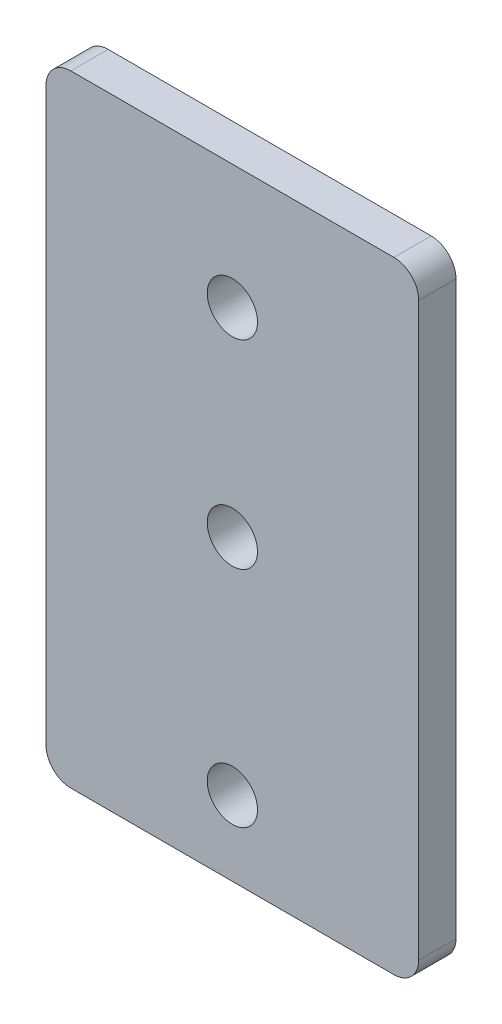
ISO-10303-21;
HEADER;
FILE_DESCRIPTION(('STEP AP214'),'2;1');
FILE_NAME('part.step','',(''),(''),'','','');
FILE_SCHEMA(('AUTOMOTIVE_DESIGN { 1 0 10303 214 1 1 1 1 }'));
ENDSEC;
DATA;
#1=APPLICATION_CONTEXT('core data for automotive mechanical design processes');
#2=APPLICATION_PROTOCOL_DEFINITION('international standard','automotive_design',2000,#1);
#3=PRODUCT_CONTEXT('',#1,'mechanical');
#4=PRODUCT('Part','Part','',(#3));
#5=PRODUCT_RELATED_PRODUCT_CATEGORY('part','',(#4));
#6=PRODUCT_DEFINITION_FORMATION('','',#4);
#7=PRODUCT_DEFINITION_CONTEXT('part definition',#1,'design');
#8=PRODUCT_DEFINITION('design','',#6,#7);
#9=PRODUCT_DEFINITION_SHAPE('','',#8);
#10=(LENGTH_UNIT() NAMED_UNIT(*) SI_UNIT(.MILLI.,.METRE.));
#11=(NAMED_UNIT(*) PLANE_ANGLE_UNIT() SI_UNIT($,.RADIAN.));
#12=(NAMED_UNIT(*) SI_UNIT($,.STERADIAN.) SOLID_ANGLE_UNIT());
#13=UNCERTAINTY_MEASURE_WITH_UNIT(LENGTH_MEASURE(1.E-05),#10,'distance_accuracy_value','');
#14=(GEOMETRIC_REPRESENTATION_CONTEXT(3) GLOBAL_UNCERTAINTY_ASSIGNED_CONTEXT((#13)) GLOBAL_UNIT_ASSIGNED_CONTEXT((#10,
#11,#12)) REPRESENTATION_CONTEXT('',''));
#15=CARTESIAN_POINT('',(0.,0.,0.));
#16=DIRECTION('',(0.,0.,1.));
#17=DIRECTION('',(1.,0.,0.));
#18=AXIS2_PLACEMENT_3D('',#15,#16,#17);
#19=CARTESIAN_POINT('',(15.,-25.,3.));
#20=DIRECTION('',(-1.,0.,0.));
#21=DIRECTION('',(0.,0.,1.));
#22=AXIS2_PLACEMENT_3D('',#19,#20,#21);
#23=PLANE('',#22);
#24=DIRECTION('',(0.,1.,0.));
#25=VECTOR('',#24,1.);
#26=CARTESIAN_POINT('',(15.,-25.,0.));
#27=LINE('',#26,#25);
#28=CARTESIAN_POINT('',(15.,-23.,0.));
#29=VERTEX_POINT('',#28);
#30=CARTESIAN_POINT('',(15.,23.,0.));
#31=VERTEX_POINT('',#30);
#32=EDGE_CURVE('E130',#29,#31,#27,.T.);
#33=ORIENTED_EDGE('',*,*,#32,.T.);
#34=DIRECTION('',(0.,0.,-1.));
#35=VECTOR('',#34,1.);
#36=CARTESIAN_POINT('',(15.,23.,3.));
#37=LINE('',#36,#35);
#38=CARTESIAN_POINT('',(15.,23.,3.));
#39=VERTEX_POINT('',#38);
#40=EDGE_CURVE('E164',#31,#39,#37,.F.);
#41=ORIENTED_EDGE('',*,*,#40,.T.);
#42=DIRECTION('',(0.,1.,0.));
#43=VECTOR('',#42,1.);
#44=CARTESIAN_POINT('',(15.,-25.,3.));
#45=LINE('',#44,#43);
#46=CARTESIAN_POINT('',(15.,-23.,3.));
#47=VERTEX_POINT('',#46);
#48=EDGE_CURVE('E128',#47,#39,#45,.T.);
#49=ORIENTED_EDGE('',*,*,#48,.F.);
#50=DIRECTION('',(0.,0.,-1.));
#51=VECTOR('',#50,1.);
#52=CARTESIAN_POINT('',(15.,-23.,3.));
#53=LINE('',#52,#51);
#54=EDGE_CURVE('E161',#47,#29,#53,.T.);
#55=ORIENTED_EDGE('',*,*,#54,.T.);
#56=EDGE_LOOP('',(#33,#41,#49,#55));
#57=FACE_BOUND('',#56,.T.);
#58=ADVANCED_FACE('F35',(#57),#23,.F.);
#59=CARTESIAN_POINT('',(-15.,25.,3.));
#60=DIRECTION('',(0.,-1.,0.));
#61=DIRECTION('',(0.,0.,-1.));
#62=AXIS2_PLACEMENT_3D('',#59,#60,#61);
#63=PLANE('',#62);
#64=DIRECTION('',(-1.,0.,0.));
#65=VECTOR('',#64,1.);
#66=CARTESIAN_POINT('',(-15.,25.,0.));
#67=LINE('',#66,#65);
#68=CARTESIAN_POINT('',(13.,25.,0.));
#69=VERTEX_POINT('',#68);
#70=CARTESIAN_POINT('',(-13.,25.,0.));
#71=VERTEX_POINT('',#70);
#72=EDGE_CURVE('E126',#69,#71,#67,.T.);
#73=ORIENTED_EDGE('',*,*,#72,.T.);
#74=DIRECTION('',(0.,0.,-1.));
#75=VECTOR('',#74,1.);
#76=CARTESIAN_POINT('',(-13.,25.,3.));
#77=LINE('',#76,#75);
#78=CARTESIAN_POINT('',(-13.,25.,3.));
#79=VERTEX_POINT('',#78);
#80=EDGE_CURVE('E105',#71,#79,#77,.F.);
#81=ORIENTED_EDGE('',*,*,#80,.T.);
#82=DIRECTION('',(-1.,0.,0.));
#83=VECTOR('',#82,1.);
#84=CARTESIAN_POINT('',(-15.,25.,3.));
#85=LINE('',#84,#83);
#86=CARTESIAN_POINT('',(13.,25.,3.));
#87=VERTEX_POINT('',#86);
#88=EDGE_CURVE('E180',#87,#79,#85,.T.);
#89=ORIENTED_EDGE('',*,*,#88,.F.);
#90=DIRECTION('',(0.,0.,-1.));
#91=VECTOR('',#90,1.);
#92=CARTESIAN_POINT('',(13.,25.,3.));
#93=LINE('',#92,#91);
#94=EDGE_CURVE('E110',#87,#69,#93,.T.);
#95=ORIENTED_EDGE('',*,*,#94,.T.);
#96=EDGE_LOOP('',(#73,#81,#89,#95));
#97=FACE_BOUND('',#96,.T.);
#98=ADVANCED_FACE('F205',(#97),#63,.F.);
#99=CARTESIAN_POINT('',(-15.,-25.,3.));
#100=DIRECTION('',(1.,0.,0.));
#101=DIRECTION('',(0.,0.,-1.));
#102=AXIS2_PLACEMENT_3D('',#99,#100,#101);
#103=PLANE('',#102);
#104=DIRECTION('',(0.,-1.,0.));
#105=VECTOR('',#104,1.);
#106=CARTESIAN_POINT('',(-15.,-25.,3.));
#107=LINE('',#106,#105);
#108=CARTESIAN_POINT('',(-15.,23.,3.));
#109=VERTEX_POINT('',#108);
#110=CARTESIAN_POINT('',(-15.,-23.,3.));
#111=VERTEX_POINT('',#110);
#112=EDGE_CURVE('E119',#109,#111,#107,.T.);
#113=ORIENTED_EDGE('',*,*,#112,.F.);
#114=DIRECTION('',(0.,0.,-1.));
#115=VECTOR('',#114,1.);
#116=CARTESIAN_POINT('',(-15.,23.,3.));
#117=LINE('',#116,#115);
#118=CARTESIAN_POINT('',(-15.,23.,0.));
#119=VERTEX_POINT('',#118);
#120=EDGE_CURVE('E104',#109,#119,#117,.T.);
#121=ORIENTED_EDGE('',*,*,#120,.T.);
#122=DIRECTION('',(0.,-1.,0.));
#123=VECTOR('',#122,1.);
#124=CARTESIAN_POINT('',(-15.,-25.,0.));
#125=LINE('',#124,#123);
#126=CARTESIAN_POINT('',(-15.,-23.,0.));
#127=VERTEX_POINT('',#126);
#128=EDGE_CURVE('E117',#119,#127,#125,.T.);
#129=ORIENTED_EDGE('',*,*,#128,.T.);
#130=DIRECTION('',(0.,0.,-1.));
#131=VECTOR('',#130,1.);
#132=CARTESIAN_POINT('',(-15.,-23.,3.));
#133=LINE('',#132,#131);
#134=EDGE_CURVE('E121',#127,#111,#133,.F.);
#135=ORIENTED_EDGE('',*,*,#134,.T.);
#136=EDGE_LOOP('',(#113,#121,#129,#135));
#137=FACE_BOUND('',#136,.T.);
#138=ADVANCED_FACE('F116',(#137),#103,.F.);
#139=CARTESIAN_POINT('',(-15.,-25.,3.));
#140=DIRECTION('',(0.,1.,0.));
#141=DIRECTION('',(0.,0.,1.));
#142=AXIS2_PLACEMENT_3D('',#139,#140,#141);
#143=PLANE('',#142);
#144=DIRECTION('',(1.,0.,0.));
#145=VECTOR('',#144,1.);
#146=CARTESIAN_POINT('',(-15.,-25.,0.));
#147=LINE('',#146,#145);
#148=CARTESIAN_POINT('',(-13.,-25.,0.));
#149=VERTEX_POINT('',#148);
#150=CARTESIAN_POINT('',(13.,-25.,0.));
#151=VERTEX_POINT('',#150);
#152=EDGE_CURVE('E125',#149,#151,#147,.T.);
#153=ORIENTED_EDGE('',*,*,#152,.T.);
#154=DIRECTION('',(0.,0.,-1.));
#155=VECTOR('',#154,1.);
#156=CARTESIAN_POINT('',(13.,-25.,3.));
#157=LINE('',#156,#155);
#158=CARTESIAN_POINT('',(13.,-25.,3.));
#159=VERTEX_POINT('',#158);
#160=EDGE_CURVE('E11',#151,#159,#157,.F.);
#161=ORIENTED_EDGE('',*,*,#160,.T.);
#162=DIRECTION('',(1.,0.,0.));
#163=VECTOR('',#162,1.);
#164=CARTESIAN_POINT('',(-15.,-25.,3.));
#165=LINE('',#164,#163);
#166=CARTESIAN_POINT('',(-13.,-25.,3.));
#167=VERTEX_POINT('',#166);
#168=EDGE_CURVE('E145',#167,#159,#165,.T.);
#169=ORIENTED_EDGE('',*,*,#168,.F.);
#170=DIRECTION('',(0.,0.,-1.));
#171=VECTOR('',#170,1.);
#172=CARTESIAN_POINT('',(-13.,-25.,3.));
#173=LINE('',#172,#171);
#174=EDGE_CURVE('E43',#167,#149,#173,.T.);
#175=ORIENTED_EDGE('',*,*,#174,.T.);
#176=EDGE_LOOP('',(#153,#161,#169,#175));
#177=FACE_BOUND('',#176,.T.);
#178=ADVANCED_FACE('F167',(#177),#143,.F.);
#179=CARTESIAN_POINT('',(0.,0.,3.));
#180=DIRECTION('',(0.,0.,-1.));
#181=DIRECTION('',(-1.,0.,0.));
#182=AXIS2_PLACEMENT_3D('',#179,#180,#181);
#183=PLANE('',#182);
#184=CARTESIAN_POINT('',(0.,-0.999999999999999,3.));
#185=DIRECTION('',(0.,0.,1.));
#186=DIRECTION('',(1.,0.,0.));
#187=AXIS2_PLACEMENT_3D('',#184,#185,#186);
#188=CIRCLE('',#187,2.025);
#189=CARTESIAN_POINT('',(2.025,-0.999999999999999,3.));
#190=VERTEX_POINT('',#189);
#191=EDGE_CURVE('E142',#190,#190,#188,.T.);
#192=ORIENTED_EDGE('',*,*,#191,.F.);
#193=EDGE_LOOP('',(#192));
#194=FACE_BOUND('',#193,.T.);
#195=CARTESIAN_POINT('',(0.,-19.,3.));
#196=DIRECTION('',(0.,0.,1.));
#197=DIRECTION('',(1.,0.,0.));
#198=AXIS2_PLACEMENT_3D('',#195,#196,#197);
#199=CIRCLE('',#198,2.025);
#200=CARTESIAN_POINT('',(2.025,-19.,3.));
#201=VERTEX_POINT('',#200);
#202=EDGE_CURVE('E316',#201,#201,#199,.T.);
#203=ORIENTED_EDGE('',*,*,#202,.F.);
#204=EDGE_LOOP('',(#203));
#205=FACE_BOUND('',#204,.T.);
#206=CARTESIAN_POINT('',(0.,15.,3.));
#207=DIRECTION('',(0.,0.,1.));
#208=DIRECTION('',(1.,0.,0.));
#209=AXIS2_PLACEMENT_3D('',#206,#207,#208);
#210=CIRCLE('',#209,2.025);
#211=CARTESIAN_POINT('',(2.025,15.,3.));
#212=VERTEX_POINT('',#211);
#213=EDGE_CURVE('E137',#212,#212,#210,.T.);
#214=ORIENTED_EDGE('',*,*,#213,.F.);
#215=EDGE_LOOP('',(#214));
#216=FACE_BOUND('',#215,.T.);
#217=ORIENTED_EDGE('',*,*,#88,.T.);
#218=CARTESIAN_POINT('',(-13.,23.,3.));
#219=DIRECTION('',(0.,0.,-1.));
#220=DIRECTION('',(-1.,0.,0.));
#221=AXIS2_PLACEMENT_3D('',#218,#219,#220);
#222=CIRCLE('',#221,2.);
#223=EDGE_CURVE('E159',#79,#109,#222,.F.);
#224=ORIENTED_EDGE('',*,*,#223,.T.);
#225=ORIENTED_EDGE('',*,*,#112,.T.);
#226=CARTESIAN_POINT('',(-13.,-23.,3.));
#227=DIRECTION('',(0.,0.,-1.));
#228=DIRECTION('',(-1.,0.,0.));
#229=AXIS2_PLACEMENT_3D('',#226,#227,#228);
#230=CIRCLE('',#229,2.);
#231=EDGE_CURVE('E55',#111,#167,#230,.F.);
#232=ORIENTED_EDGE('',*,*,#231,.T.);
#233=ORIENTED_EDGE('',*,*,#168,.T.);
#234=CARTESIAN_POINT('',(13.,-23.,3.));
#235=DIRECTION('',(0.,0.,-1.));
#236=DIRECTION('',(-1.,0.,0.));
#237=AXIS2_PLACEMENT_3D('',#234,#235,#236);
#238=CIRCLE('',#237,2.);
#239=EDGE_CURVE('E155',#159,#47,#238,.F.);
#240=ORIENTED_EDGE('',*,*,#239,.T.);
#241=ORIENTED_EDGE('',*,*,#48,.T.);
#242=CARTESIAN_POINT('',(13.,23.,3.));
#243=DIRECTION('',(0.,0.,-1.));
#244=DIRECTION('',(-1.,0.,0.));
#245=AXIS2_PLACEMENT_3D('',#242,#243,#244);
#246=CIRCLE('',#245,2.);
#247=EDGE_CURVE('E157',#39,#87,#246,.F.);
#248=ORIENTED_EDGE('',*,*,#247,.T.);
#249=EDGE_LOOP('',(#217,#224,#225,#232,#233,#240,#241,#248));
#250=FACE_BOUND('',#249,.T.);
#251=ADVANCED_FACE('F188',(#194,#205,#216,#250),#183,.F.);
#252=CARTESIAN_POINT('',(0.,0.,0.));
#253=DIRECTION('',(0.,0.,-1.));
#254=DIRECTION('',(-1.,0.,0.));
#255=AXIS2_PLACEMENT_3D('',#252,#253,#254);
#256=PLANE('',#255);
#257=CARTESIAN_POINT('',(0.,-0.999999999999999,0.));
#258=DIRECTION('',(0.,0.,-1.));
#259=DIRECTION('',(-1.,0.,0.));
#260=AXIS2_PLACEMENT_3D('',#257,#258,#259);
#261=CIRCLE('',#260,2.025);
#262=CARTESIAN_POINT('',(-2.025,-0.999999999999999,0.));
#263=VERTEX_POINT('',#262);
#264=EDGE_CURVE('E141',#263,#263,#261,.T.);
#265=ORIENTED_EDGE('',*,*,#264,.F.);
#266=EDGE_LOOP('',(#265));
#267=FACE_BOUND('',#266,.T.);
#268=CARTESIAN_POINT('',(0.,-19.,0.));
#269=DIRECTION('',(0.,0.,-1.));
#270=DIRECTION('',(-1.,0.,0.));
#271=AXIS2_PLACEMENT_3D('',#268,#269,#270);
#272=CIRCLE('',#271,2.025);
#273=CARTESIAN_POINT('',(-2.025,-19.,0.));
#274=VERTEX_POINT('',#273);
#275=EDGE_CURVE('E138',#274,#274,#272,.T.);
#276=ORIENTED_EDGE('',*,*,#275,.F.);
#277=EDGE_LOOP('',(#276));
#278=FACE_BOUND('',#277,.T.);
#279=CARTESIAN_POINT('',(0.,15.,0.));
#280=DIRECTION('',(0.,0.,-1.));
#281=DIRECTION('',(-1.,0.,0.));
#282=AXIS2_PLACEMENT_3D('',#279,#280,#281);
#283=CIRCLE('',#282,2.025);
#284=CARTESIAN_POINT('',(-2.025,15.,0.));
#285=VERTEX_POINT('',#284);
#286=EDGE_CURVE('E134',#285,#285,#283,.T.);
#287=ORIENTED_EDGE('',*,*,#286,.F.);
#288=EDGE_LOOP('',(#287));
#289=FACE_BOUND('',#288,.T.);
#290=ORIENTED_EDGE('',*,*,#128,.F.);
#291=CARTESIAN_POINT('',(-13.,23.,0.));
#292=DIRECTION('',(0.,0.,-1.));
#293=DIRECTION('',(-1.,0.,0.));
#294=AXIS2_PLACEMENT_3D('',#291,#292,#293);
#295=CIRCLE('',#294,2.);
#296=EDGE_CURVE('E100',#119,#71,#295,.T.);
#297=ORIENTED_EDGE('',*,*,#296,.T.);
#298=ORIENTED_EDGE('',*,*,#72,.F.);
#299=CARTESIAN_POINT('',(13.,23.,0.));
#300=DIRECTION('',(0.,0.,-1.));
#301=DIRECTION('',(-1.,0.,0.));
#302=AXIS2_PLACEMENT_3D('',#299,#300,#301);
#303=CIRCLE('',#302,2.);
#304=EDGE_CURVE('E111',#69,#31,#303,.T.);
#305=ORIENTED_EDGE('',*,*,#304,.T.);
#306=ORIENTED_EDGE('',*,*,#32,.F.);
#307=CARTESIAN_POINT('',(13.,-23.,0.));
#308=DIRECTION('',(0.,0.,-1.));
#309=DIRECTION('',(-1.,0.,0.));
#310=AXIS2_PLACEMENT_3D('',#307,#308,#309);
#311=CIRCLE('',#310,2.);
#312=EDGE_CURVE('E148',#29,#151,#311,.T.);
#313=ORIENTED_EDGE('',*,*,#312,.T.);
#314=ORIENTED_EDGE('',*,*,#152,.F.);
#315=CARTESIAN_POINT('',(-13.,-23.,0.));
#316=DIRECTION('',(0.,0.,-1.));
#317=DIRECTION('',(-1.,0.,0.));
#318=AXIS2_PLACEMENT_3D('',#315,#316,#317);
#319=CIRCLE('',#318,2.);
#320=EDGE_CURVE('E120',#149,#127,#319,.T.);
#321=ORIENTED_EDGE('',*,*,#320,.T.);
#322=EDGE_LOOP('',(#290,#297,#298,#305,#306,#313,#314,#321));
#323=FACE_BOUND('',#322,.T.);
#324=ADVANCED_FACE('F123',(#267,#278,#289,#323),#256,.T.);
#325=CARTESIAN_POINT('',(0.,15.,-1.));
#326=DIRECTION('',(0.,0.,1.));
#327=DIRECTION('',(1.,0.,0.));
#328=AXIS2_PLACEMENT_3D('',#325,#326,#327);
#329=CYLINDRICAL_SURFACE('',#328,2.025);
#330=ORIENTED_EDGE('',*,*,#286,.T.);
#331=EDGE_LOOP('',(#330));
#332=FACE_BOUND('',#331,.T.);
#333=ORIENTED_EDGE('',*,*,#213,.T.);
#334=EDGE_LOOP('',(#333));
#335=FACE_BOUND('',#334,.T.);
#336=ADVANCED_FACE('F197',(#332,#335),#329,.F.);
#337=CARTESIAN_POINT('',(0.,-19.,-31.));
#338=DIRECTION('',(0.,0.,1.));
#339=DIRECTION('',(1.,0.,0.));
#340=AXIS2_PLACEMENT_3D('',#337,#338,#339);
#341=CYLINDRICAL_SURFACE('',#340,2.025);
#342=ORIENTED_EDGE('',*,*,#275,.T.);
#343=EDGE_LOOP('',(#342));
#344=FACE_BOUND('',#343,.T.);
#345=ORIENTED_EDGE('',*,*,#202,.T.);
#346=EDGE_LOOP('',(#345));
#347=FACE_BOUND('',#346,.T.);
#348=ADVANCED_FACE('F286',(#344,#347),#341,.F.);
#349=CARTESIAN_POINT('',(0.,-0.999999999999999,-31.));
#350=DIRECTION('',(0.,0.,1.));
#351=DIRECTION('',(1.,0.,0.));
#352=AXIS2_PLACEMENT_3D('',#349,#350,#351);
#353=CYLINDRICAL_SURFACE('',#352,2.025);
#354=ORIENTED_EDGE('',*,*,#264,.T.);
#355=EDGE_LOOP('',(#354));
#356=FACE_BOUND('',#355,.T.);
#357=ORIENTED_EDGE('',*,*,#191,.T.);
#358=EDGE_LOOP('',(#357));
#359=FACE_BOUND('',#358,.T.);
#360=ADVANCED_FACE('F217',(#356,#359),#353,.F.);
#361=CARTESIAN_POINT('',(-13.,23.,3.));
#362=DIRECTION('',(0.,0.,-1.));
#363=DIRECTION('',(-1.,0.,0.));
#364=AXIS2_PLACEMENT_3D('',#361,#362,#363);
#365=CYLINDRICAL_SURFACE('',#364,2.);
#366=ORIENTED_EDGE('',*,*,#223,.F.);
#367=ORIENTED_EDGE('',*,*,#80,.F.);
#368=ORIENTED_EDGE('',*,*,#296,.F.);
#369=ORIENTED_EDGE('',*,*,#120,.F.);
#370=EDGE_LOOP('',(#366,#367,#368,#369));
#371=FACE_BOUND('',#370,.T.);
#372=ADVANCED_FACE('F103',(#371),#365,.T.);
#373=CARTESIAN_POINT('',(13.,23.,3.));
#374=DIRECTION('',(0.,0.,-1.));
#375=DIRECTION('',(-1.,0.,0.));
#376=AXIS2_PLACEMENT_3D('',#373,#374,#375);
#377=CYLINDRICAL_SURFACE('',#376,2.);
#378=ORIENTED_EDGE('',*,*,#247,.F.);
#379=ORIENTED_EDGE('',*,*,#40,.F.);
#380=ORIENTED_EDGE('',*,*,#304,.F.);
#381=ORIENTED_EDGE('',*,*,#94,.F.);
#382=EDGE_LOOP('',(#378,#379,#380,#381));
#383=FACE_BOUND('',#382,.T.);
#384=ADVANCED_FACE('F216',(#383),#377,.T.);
#385=CARTESIAN_POINT('',(13.,-23.,3.));
#386=DIRECTION('',(0.,0.,-1.));
#387=DIRECTION('',(-1.,0.,0.));
#388=AXIS2_PLACEMENT_3D('',#385,#386,#387);
#389=CYLINDRICAL_SURFACE('',#388,2.);
#390=ORIENTED_EDGE('',*,*,#239,.F.);
#391=ORIENTED_EDGE('',*,*,#160,.F.);
#392=ORIENTED_EDGE('',*,*,#312,.F.);
#393=ORIENTED_EDGE('',*,*,#54,.F.);
#394=EDGE_LOOP('',(#390,#391,#392,#393));
#395=FACE_BOUND('',#394,.T.);
#396=ADVANCED_FACE('F174',(#395),#389,.T.);
#397=CARTESIAN_POINT('',(-13.,-23.,3.));
#398=DIRECTION('',(0.,0.,-1.));
#399=DIRECTION('',(-1.,0.,0.));
#400=AXIS2_PLACEMENT_3D('',#397,#398,#399);
#401=CYLINDRICAL_SURFACE('',#400,2.);
#402=ORIENTED_EDGE('',*,*,#231,.F.);
#403=ORIENTED_EDGE('',*,*,#134,.F.);
#404=ORIENTED_EDGE('',*,*,#320,.F.);
#405=ORIENTED_EDGE('',*,*,#174,.F.);
#406=EDGE_LOOP('',(#402,#403,#404,#405));
#407=FACE_BOUND('',#406,.T.);
#408=ADVANCED_FACE('F37',(#407),#401,.T.);
#409=CLOSED_SHELL('',(#58,#98,#138,#178,#251,#324,#336,#348,#360,#372,#384,#396,#408));
#410=MANIFOLD_SOLID_BREP('B2',#409);
#411=ADVANCED_BREP_SHAPE_REPRESENTATION('',(#18,#410),#14);
#412=SHAPE_DEFINITION_REPRESENTATION(#9,#411);
ENDSEC;
END-ISO-10303-21;
